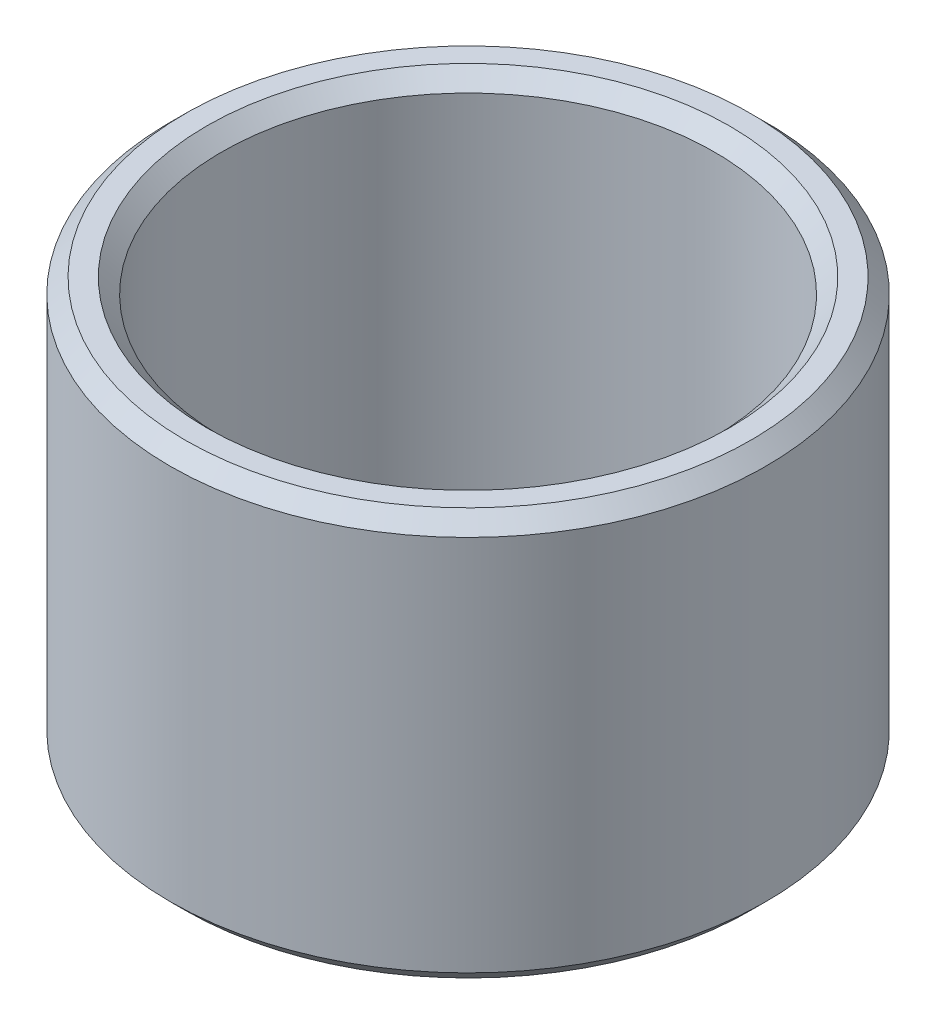
ISO-10303-21;
HEADER;
FILE_DESCRIPTION(('STEP AP214'),'2;1');
FILE_NAME('part.step','',(''),(''),'','','');
FILE_SCHEMA(('AUTOMOTIVE_DESIGN { 1 0 10303 214 1 1 1 1 }'));
ENDSEC;
DATA;
#1=APPLICATION_CONTEXT('core data for automotive mechanical design processes');
#2=APPLICATION_PROTOCOL_DEFINITION('international standard','automotive_design',2000,#1);
#3=PRODUCT_CONTEXT('',#1,'mechanical');
#4=PRODUCT('Part','Part','',(#3));
#5=PRODUCT_RELATED_PRODUCT_CATEGORY('part','',(#4));
#6=PRODUCT_DEFINITION_FORMATION('','',#4);
#7=PRODUCT_DEFINITION_CONTEXT('part definition',#1,'design');
#8=PRODUCT_DEFINITION('design','',#6,#7);
#9=PRODUCT_DEFINITION_SHAPE('','',#8);
#10=(LENGTH_UNIT() NAMED_UNIT(*) SI_UNIT(.MILLI.,.METRE.));
#11=(NAMED_UNIT(*) PLANE_ANGLE_UNIT() SI_UNIT($,.RADIAN.));
#12=(NAMED_UNIT(*) SI_UNIT($,.STERADIAN.) SOLID_ANGLE_UNIT());
#13=UNCERTAINTY_MEASURE_WITH_UNIT(LENGTH_MEASURE(1.E-05),#10,'distance_accuracy_value','');
#14=(GEOMETRIC_REPRESENTATION_CONTEXT(3) GLOBAL_UNCERTAINTY_ASSIGNED_CONTEXT((#13)) GLOBAL_UNIT_ASSIGNED_CONTEXT((#10,
#11,#12)) REPRESENTATION_CONTEXT('',''));
#15=CARTESIAN_POINT('',(0.,0.,0.));
#16=DIRECTION('',(0.,0.,1.));
#17=DIRECTION('',(1.,0.,0.));
#18=AXIS2_PLACEMENT_3D('',#15,#16,#17);
#19=CARTESIAN_POINT('',(0.,54.6708016961488,0.));
#20=DIRECTION('',(0.,-1.,0.));
#21=DIRECTION('',(0.,0.,-1.));
#22=AXIS2_PLACEMENT_3D('',#19,#20,#21);
#23=CYLINDRICAL_SURFACE('',#22,40.);
#24=CARTESIAN_POINT('',(0.,2.01787485716313,0.));
#25=DIRECTION('',(0.,1.,0.));
#26=DIRECTION('',(0.,0.,1.));
#27=AXIS2_PLACEMENT_3D('',#24,#25,#26);
#28=CIRCLE('',#27,40.);
#29=CARTESIAN_POINT('',(0.,2.01787485716313,40.));
#30=VERTEX_POINT('',#29);
#31=EDGE_CURVE('E10',#30,#30,#28,.T.);
#32=ORIENTED_EDGE('',*,*,#31,.T.);
#33=EDGE_LOOP('',(#32));
#34=FACE_BOUND('',#33,.T.);
#35=CARTESIAN_POINT('',(0.,52.6529268389857,0.));
#36=DIRECTION('',(0.,1.,0.));
#37=DIRECTION('',(0.,0.,1.));
#38=AXIS2_PLACEMENT_3D('',#35,#36,#37);
#39=CIRCLE('',#38,40.);
#40=CARTESIAN_POINT('',(0.,52.6529268389857,40.));
#41=VERTEX_POINT('',#40);
#42=EDGE_CURVE('E50',#41,#41,#39,.F.);
#43=ORIENTED_EDGE('',*,*,#42,.T.);
#44=EDGE_LOOP('',(#43));
#45=FACE_BOUND('',#44,.T.);
#46=ADVANCED_FACE('F39',(#34,#45),#23,.T.);
#47=CARTESIAN_POINT('',(0.,54.6708016961488,0.));
#48=DIRECTION('',(0.,1.,0.));
#49=DIRECTION('',(0.,0.,1.));
#50=AXIS2_PLACEMENT_3D('',#47,#48,#49);
#51=PLANE('',#50);
#52=CARTESIAN_POINT('',(0.,54.6708016961488,0.));
#53=DIRECTION('',(0.,1.,0.));
#54=DIRECTION('',(0.,0.,1.));
#55=AXIS2_PLACEMENT_3D('',#52,#53,#54);
#56=CIRCLE('',#55,35.1062429445855);
#57=CARTESIAN_POINT('',(0.,54.6708016961488,35.1062429445855));
#58=VERTEX_POINT('',#57);
#59=EDGE_CURVE('E58',#58,#58,#56,.F.);
#60=ORIENTED_EDGE('',*,*,#59,.T.);
#61=EDGE_LOOP('',(#60));
#62=FACE_BOUND('',#61,.T.);
#63=CARTESIAN_POINT('',(0.,54.6708016961488,0.));
#64=DIRECTION('',(0.,1.,0.));
#65=DIRECTION('',(0.,0.,1.));
#66=AXIS2_PLACEMENT_3D('',#63,#64,#65);
#67=CIRCLE('',#66,37.9821251428369);
#68=CARTESIAN_POINT('',(0.,54.6708016961488,37.9821251428369));
#69=VERTEX_POINT('',#68);
#70=EDGE_CURVE('E61',#69,#69,#67,.T.);
#71=ORIENTED_EDGE('',*,*,#70,.T.);
#72=EDGE_LOOP('',(#71));
#73=FACE_BOUND('',#72,.T.);
#74=ADVANCED_FACE('F88',(#62,#73),#51,.T.);
#75=CARTESIAN_POINT('',(0.,0.,0.));
#76=DIRECTION('',(0.,1.,0.));
#77=DIRECTION('',(0.,0.,1.));
#78=AXIS2_PLACEMENT_3D('',#75,#76,#77);
#79=PLANE('',#78);
#80=CARTESIAN_POINT('',(0.,0.,0.));
#81=DIRECTION('',(0.,1.,0.));
#82=DIRECTION('',(0.,0.,1.));
#83=AXIS2_PLACEMENT_3D('',#80,#81,#82);
#84=CIRCLE('',#83,35.1062429445855);
#85=CARTESIAN_POINT('',(0.,0.,35.1062429445855));
#86=VERTEX_POINT('',#85);
#87=EDGE_CURVE('E51',#86,#86,#84,.T.);
#88=ORIENTED_EDGE('',*,*,#87,.T.);
#89=EDGE_LOOP('',(#88));
#90=FACE_BOUND('',#89,.T.);
#91=CARTESIAN_POINT('',(0.,0.,0.));
#92=DIRECTION('',(0.,1.,0.));
#93=DIRECTION('',(0.,0.,1.));
#94=AXIS2_PLACEMENT_3D('',#91,#92,#93);
#95=CIRCLE('',#94,37.9821251428369);
#96=CARTESIAN_POINT('',(0.,0.,37.9821251428369));
#97=VERTEX_POINT('',#96);
#98=EDGE_CURVE('E54',#97,#97,#95,.F.);
#99=ORIENTED_EDGE('',*,*,#98,.T.);
#100=EDGE_LOOP('',(#99));
#101=FACE_BOUND('',#100,.T.);
#102=ADVANCED_FACE('F83',(#90,#101),#79,.F.);
#103=CARTESIAN_POINT('',(0.,54.6708016961488,0.));
#104=DIRECTION('',(0.,-1.,0.));
#105=DIRECTION('',(0.,0.,-1.));
#106=AXIS2_PLACEMENT_3D('',#103,#104,#105);
#107=CYLINDRICAL_SURFACE('',#106,33.0883680874224);
#108=CARTESIAN_POINT('',(0.,52.6529268389857,0.));
#109=DIRECTION('',(0.,1.,0.));
#110=DIRECTION('',(0.,0.,1.));
#111=AXIS2_PLACEMENT_3D('',#108,#109,#110);
#112=CIRCLE('',#111,33.0883680874224);
#113=CARTESIAN_POINT('',(0.,52.6529268389857,33.0883680874224));
#114=VERTEX_POINT('',#113);
#115=EDGE_CURVE('E67',#114,#114,#112,.T.);
#116=ORIENTED_EDGE('',*,*,#115,.T.);
#117=EDGE_LOOP('',(#116));
#118=FACE_BOUND('',#117,.T.);
#119=CARTESIAN_POINT('',(0.,2.01787485716311,0.));
#120=DIRECTION('',(0.,1.,0.));
#121=DIRECTION('',(0.,0.,1.));
#122=AXIS2_PLACEMENT_3D('',#119,#120,#121);
#123=CIRCLE('',#122,33.0883680874224);
#124=CARTESIAN_POINT('',(0.,2.01787485716311,33.0883680874224));
#125=VERTEX_POINT('',#124);
#126=EDGE_CURVE('E69',#125,#125,#123,.F.);
#127=ORIENTED_EDGE('',*,*,#126,.T.);
#128=EDGE_LOOP('',(#127));
#129=FACE_BOUND('',#128,.T.);
#130=ADVANCED_FACE('F71',(#118,#129),#107,.F.);
#131=CARTESIAN_POINT('',(0.,52.6529268389857,0.));
#132=DIRECTION('',(0.,1.,0.));
#133=DIRECTION('',(0.,0.,1.));
#134=AXIS2_PLACEMENT_3D('',#131,#132,#133);
#135=CONICAL_SURFACE('',#134,33.0883680874224,0.785398163397453);
#136=ORIENTED_EDGE('',*,*,#59,.F.);
#137=EDGE_LOOP('',(#136));
#138=FACE_BOUND('',#137,.T.);
#139=ORIENTED_EDGE('',*,*,#115,.F.);
#140=EDGE_LOOP('',(#139));
#141=FACE_BOUND('',#140,.T.);
#142=ADVANCED_FACE('F77',(#138,#141),#135,.F.);
#143=CARTESIAN_POINT('',(0.,0.,0.));
#144=DIRECTION('',(0.,-1.,0.));
#145=DIRECTION('',(0.,0.,-1.));
#146=AXIS2_PLACEMENT_3D('',#143,#144,#145);
#147=CONICAL_SURFACE('',#146,35.1062429445855,0.785398163397447);
#148=ORIENTED_EDGE('',*,*,#126,.F.);
#149=EDGE_LOOP('',(#148));
#150=FACE_BOUND('',#149,.T.);
#151=ORIENTED_EDGE('',*,*,#87,.F.);
#152=EDGE_LOOP('',(#151));
#153=FACE_BOUND('',#152,.T.);
#154=ADVANCED_FACE('F73',(#150,#153),#147,.F.);
#155=CARTESIAN_POINT('',(0.,2.01787485716313,0.));
#156=DIRECTION('',(0.,1.,0.));
#157=DIRECTION('',(0.,0.,1.));
#158=AXIS2_PLACEMENT_3D('',#155,#156,#157);
#159=CONICAL_SURFACE('',#158,40.,0.785398163397452);
#160=ORIENTED_EDGE('',*,*,#98,.F.);
#161=EDGE_LOOP('',(#160));
#162=FACE_BOUND('',#161,.T.);
#163=ORIENTED_EDGE('',*,*,#31,.F.);
#164=EDGE_LOOP('',(#163));
#165=FACE_BOUND('',#164,.T.);
#166=ADVANCED_FACE('F76',(#162,#165),#159,.T.);
#167=CARTESIAN_POINT('',(0.,54.6708016961488,0.));
#168=DIRECTION('',(0.,-1.,0.));
#169=DIRECTION('',(0.,0.,-1.));
#170=AXIS2_PLACEMENT_3D('',#167,#168,#169);
#171=CONICAL_SURFACE('',#170,37.9821251428369,0.785398163397447);
#172=ORIENTED_EDGE('',*,*,#42,.F.);
#173=EDGE_LOOP('',(#172));
#174=FACE_BOUND('',#173,.T.);
#175=ORIENTED_EDGE('',*,*,#70,.F.);
#176=EDGE_LOOP('',(#175));
#177=FACE_BOUND('',#176,.T.);
#178=ADVANCED_FACE('F45',(#174,#177),#171,.T.);
#179=CLOSED_SHELL('',(#46,#74,#102,#130,#142,#154,#166,#178));
#180=MANIFOLD_SOLID_BREP('B2',#179);
#181=ADVANCED_BREP_SHAPE_REPRESENTATION('',(#18,#180),#14);
#182=SHAPE_DEFINITION_REPRESENTATION(#9,#181);
ENDSEC;
END-ISO-10303-21;
